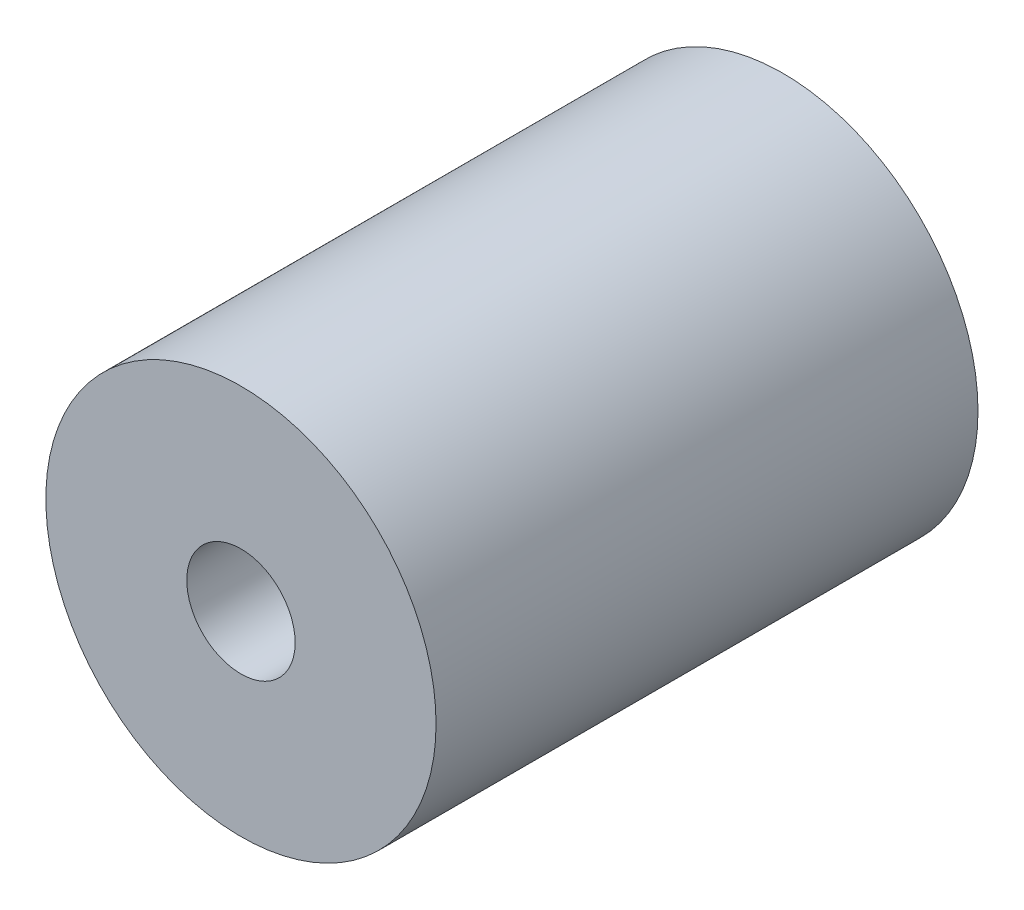
ISO-10303-21;
HEADER;
FILE_DESCRIPTION(('STEP AP214'),'2;1');
FILE_NAME('part.step','',(''),(''),'','','');
FILE_SCHEMA(('AUTOMOTIVE_DESIGN { 1 0 10303 214 1 1 1 1 }'));
ENDSEC;
DATA;
#1=APPLICATION_CONTEXT('core data for automotive mechanical design processes');
#2=APPLICATION_PROTOCOL_DEFINITION('international standard','automotive_design',2000,#1);
#3=PRODUCT_CONTEXT('',#1,'mechanical');
#4=PRODUCT('Part','Part','',(#3));
#5=PRODUCT_RELATED_PRODUCT_CATEGORY('part','',(#4));
#6=PRODUCT_DEFINITION_FORMATION('','',#4);
#7=PRODUCT_DEFINITION_CONTEXT('part definition',#1,'design');
#8=PRODUCT_DEFINITION('design','',#6,#7);
#9=PRODUCT_DEFINITION_SHAPE('','',#8);
#10=(LENGTH_UNIT() NAMED_UNIT(*) SI_UNIT(.MILLI.,.METRE.));
#11=(NAMED_UNIT(*) PLANE_ANGLE_UNIT() SI_UNIT($,.RADIAN.));
#12=(NAMED_UNIT(*) SI_UNIT($,.STERADIAN.) SOLID_ANGLE_UNIT());
#13=UNCERTAINTY_MEASURE_WITH_UNIT(LENGTH_MEASURE(1.E-05),#10,'distance_accuracy_value','');
#14=(GEOMETRIC_REPRESENTATION_CONTEXT(3) GLOBAL_UNCERTAINTY_ASSIGNED_CONTEXT((#13)) GLOBAL_UNIT_ASSIGNED_CONTEXT((#10,
#11,#12)) REPRESENTATION_CONTEXT('',''));
#15=CARTESIAN_POINT('',(0.,0.,0.));
#16=DIRECTION('',(0.,0.,1.));
#17=DIRECTION('',(1.,0.,0.));
#18=AXIS2_PLACEMENT_3D('',#15,#16,#17);
#19=CARTESIAN_POINT('',(0.,0.,-12.5));
#20=DIRECTION('',(0.,0.,1.));
#21=DIRECTION('',(1.,0.,0.));
#22=AXIS2_PLACEMENT_3D('',#19,#20,#21);
#23=CYLINDRICAL_SURFACE('',#22,2.5);
#24=CARTESIAN_POINT('',(0.,0.,12.5));
#25=DIRECTION('',(0.,0.,1.));
#26=DIRECTION('',(1.,0.,0.));
#27=AXIS2_PLACEMENT_3D('',#24,#25,#26);
#28=CIRCLE('',#27,2.5);
#29=CARTESIAN_POINT('',(2.5,0.,12.5));
#30=VERTEX_POINT('',#29);
#31=EDGE_CURVE('E52',#30,#30,#28,.T.);
#32=ORIENTED_EDGE('',*,*,#31,.T.);
#33=EDGE_LOOP('',(#32));
#34=FACE_BOUND('',#33,.T.);
#35=CARTESIAN_POINT('',(0.,0.,5.));
#36=DIRECTION('',(0.,0.,-1.));
#37=DIRECTION('',(-1.,0.,0.));
#38=AXIS2_PLACEMENT_3D('',#35,#36,#37);
#39=CIRCLE('',#38,2.5);
#40=CARTESIAN_POINT('',(-2.5,0.,5.));
#41=VERTEX_POINT('',#40);
#42=EDGE_CURVE('E41',#41,#41,#39,.F.);
#43=ORIENTED_EDGE('',*,*,#42,.F.);
#44=EDGE_LOOP('',(#43));
#45=FACE_BOUND('',#44,.T.);
#46=ADVANCED_FACE('F37',(#34,#45),#23,.F.);
#47=CARTESIAN_POINT('',(0.,0.,12.5));
#48=DIRECTION('',(0.,0.,-1.));
#49=DIRECTION('',(-1.,0.,0.));
#50=AXIS2_PLACEMENT_3D('',#47,#48,#49);
#51=CYLINDRICAL_SURFACE('',#50,9.);
#52=CARTESIAN_POINT('',(0.,0.,12.5));
#53=DIRECTION('',(0.,0.,1.));
#54=DIRECTION('',(1.,0.,0.));
#55=AXIS2_PLACEMENT_3D('',#52,#53,#54);
#56=CIRCLE('',#55,9.);
#57=CARTESIAN_POINT('',(9.,0.,12.5));
#58=VERTEX_POINT('',#57);
#59=EDGE_CURVE('E10',#58,#58,#56,.T.);
#60=ORIENTED_EDGE('',*,*,#59,.F.);
#61=EDGE_LOOP('',(#60));
#62=FACE_BOUND('',#61,.T.);
#63=CARTESIAN_POINT('',(0.,0.,-12.5));
#64=DIRECTION('',(0.,0.,1.));
#65=DIRECTION('',(1.,0.,0.));
#66=AXIS2_PLACEMENT_3D('',#63,#64,#65);
#67=CIRCLE('',#66,9.);
#68=CARTESIAN_POINT('',(9.,0.,-12.5));
#69=VERTEX_POINT('',#68);
#70=EDGE_CURVE('E46',#69,#69,#67,.T.);
#71=ORIENTED_EDGE('',*,*,#70,.T.);
#72=EDGE_LOOP('',(#71));
#73=FACE_BOUND('',#72,.T.);
#74=ADVANCED_FACE('F39',(#62,#73),#51,.T.);
#75=CARTESIAN_POINT('',(0.,0.,12.5));
#76=DIRECTION('',(0.,0.,1.));
#77=DIRECTION('',(1.,0.,0.));
#78=AXIS2_PLACEMENT_3D('',#75,#76,#77);
#79=PLANE('',#78);
#80=ORIENTED_EDGE('',*,*,#31,.F.);
#81=EDGE_LOOP('',(#80));
#82=FACE_BOUND('',#81,.T.);
#83=ORIENTED_EDGE('',*,*,#59,.T.);
#84=EDGE_LOOP('',(#83));
#85=FACE_BOUND('',#84,.T.);
#86=ADVANCED_FACE('F78',(#82,#85),#79,.T.);
#87=CARTESIAN_POINT('',(0.,0.,-12.5));
#88=DIRECTION('',(0.,0.,1.));
#89=DIRECTION('',(1.,0.,0.));
#90=AXIS2_PLACEMENT_3D('',#87,#88,#89);
#91=PLANE('',#90);
#92=CARTESIAN_POINT('',(0.,0.,-12.5));
#93=DIRECTION('',(0.,0.,-1.));
#94=DIRECTION('',(-1.,0.,0.));
#95=AXIS2_PLACEMENT_3D('',#92,#93,#94);
#96=CIRCLE('',#95,4.);
#97=CARTESIAN_POINT('',(-4.,0.,-12.5));
#98=VERTEX_POINT('',#97);
#99=EDGE_CURVE('E57',#98,#98,#96,.T.);
#100=ORIENTED_EDGE('',*,*,#99,.F.);
#101=EDGE_LOOP('',(#100));
#102=FACE_BOUND('',#101,.T.);
#103=ORIENTED_EDGE('',*,*,#70,.F.);
#104=EDGE_LOOP('',(#103));
#105=FACE_BOUND('',#104,.T.);
#106=ADVANCED_FACE('F85',(#102,#105),#91,.F.);
#107=CARTESIAN_POINT('',(0.,0.,5.));
#108=DIRECTION('',(0.,0.,-1.));
#109=DIRECTION('',(-1.,0.,0.));
#110=AXIS2_PLACEMENT_3D('',#107,#108,#109);
#111=PLANE('',#110);
#112=CARTESIAN_POINT('',(0.,0.,5.));
#113=DIRECTION('',(0.,0.,-1.));
#114=DIRECTION('',(-1.,0.,0.));
#115=AXIS2_PLACEMENT_3D('',#112,#113,#114);
#116=CIRCLE('',#115,4.);
#117=CARTESIAN_POINT('',(-4.,0.,5.));
#118=VERTEX_POINT('',#117);
#119=EDGE_CURVE('E61',#118,#118,#116,.T.);
#120=ORIENTED_EDGE('',*,*,#119,.T.);
#121=EDGE_LOOP('',(#120));
#122=FACE_BOUND('',#121,.T.);
#123=ORIENTED_EDGE('',*,*,#42,.T.);
#124=EDGE_LOOP('',(#123));
#125=FACE_BOUND('',#124,.T.);
#126=ADVANCED_FACE('F70',(#122,#125),#111,.T.);
#127=CARTESIAN_POINT('',(0.,0.,5.));
#128=DIRECTION('',(0.,0.,-1.));
#129=DIRECTION('',(-1.,0.,0.));
#130=AXIS2_PLACEMENT_3D('',#127,#128,#129);
#131=CYLINDRICAL_SURFACE('',#130,4.);
#132=ORIENTED_EDGE('',*,*,#119,.F.);
#133=EDGE_LOOP('',(#132));
#134=FACE_BOUND('',#133,.T.);
#135=ORIENTED_EDGE('',*,*,#99,.T.);
#136=EDGE_LOOP('',(#135));
#137=FACE_BOUND('',#136,.T.);
#138=ADVANCED_FACE('F82',(#134,#137),#131,.F.);
#139=CLOSED_SHELL('',(#46,#74,#86,#106,#126,#138));
#140=MANIFOLD_SOLID_BREP('B2',#139);
#141=ADVANCED_BREP_SHAPE_REPRESENTATION('',(#18,#140),#14);
#142=SHAPE_DEFINITION_REPRESENTATION(#9,#141);
ENDSEC;
END-ISO-10303-21;
